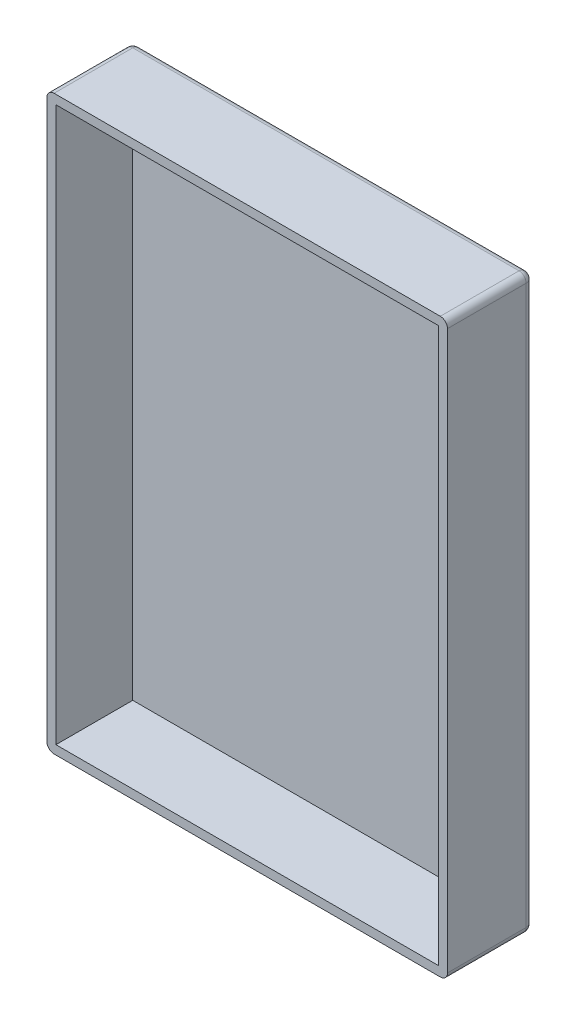
ISO-10303-21;
HEADER;
FILE_DESCRIPTION(('STEP AP214'),'2;1');
FILE_NAME('part.step','',(''),(''),'','','');
FILE_SCHEMA(('AUTOMOTIVE_DESIGN { 1 0 10303 214 1 1 1 1 }'));
ENDSEC;
DATA;
#1=APPLICATION_CONTEXT('core data for automotive mechanical design processes');
#2=APPLICATION_PROTOCOL_DEFINITION('international standard','automotive_design',2000,#1);
#3=PRODUCT_CONTEXT('',#1,'mechanical');
#4=PRODUCT('Part','Part','',(#3));
#5=PRODUCT_RELATED_PRODUCT_CATEGORY('part','',(#4));
#6=PRODUCT_DEFINITION_FORMATION('','',#4);
#7=PRODUCT_DEFINITION_CONTEXT('part definition',#1,'design');
#8=PRODUCT_DEFINITION('design','',#6,#7);
#9=PRODUCT_DEFINITION_SHAPE('','',#8);
#10=(LENGTH_UNIT() NAMED_UNIT(*) SI_UNIT(.MILLI.,.METRE.));
#11=(NAMED_UNIT(*) PLANE_ANGLE_UNIT() SI_UNIT($,.RADIAN.));
#12=(NAMED_UNIT(*) SI_UNIT($,.STERADIAN.) SOLID_ANGLE_UNIT());
#13=UNCERTAINTY_MEASURE_WITH_UNIT(LENGTH_MEASURE(1.E-05),#10,'distance_accuracy_value','');
#14=(GEOMETRIC_REPRESENTATION_CONTEXT(3) GLOBAL_UNCERTAINTY_ASSIGNED_CONTEXT((#13)) GLOBAL_UNIT_ASSIGNED_CONTEXT((#10,
#11,#12)) REPRESENTATION_CONTEXT('',''));
#15=CARTESIAN_POINT('',(0.,0.,0.));
#16=DIRECTION('',(0.,0.,1.));
#17=DIRECTION('',(1.,0.,0.));
#18=AXIS2_PLACEMENT_3D('',#15,#16,#17);
#19=CARTESIAN_POINT('',(44.45,-63.5,19.05));
#20=DIRECTION('',(0.,0.,-1.));
#21=DIRECTION('',(-1.,0.,0.));
#22=AXIS2_PLACEMENT_3D('',#19,#20,#21);
#23=PLANE('',#22);
#24=DIRECTION('',(1.,0.,0.));
#25=VECTOR('',#24,1.);
#26=CARTESIAN_POINT('',(-44.45,-63.5,19.05));
#27=LINE('',#26,#25);
#28=CARTESIAN_POINT('',(-42.8625,-63.5,19.05));
#29=VERTEX_POINT('',#28);
#30=CARTESIAN_POINT('',(42.8625,-63.5,19.05));
#31=VERTEX_POINT('',#30);
#32=EDGE_CURVE('E185',#29,#31,#27,.T.);
#33=ORIENTED_EDGE('',*,*,#32,.T.);
#34=CARTESIAN_POINT('',(42.8625,-61.9125,19.05));
#35=DIRECTION('',(0.,0.,-1.));
#36=DIRECTION('',(-1.,0.,0.));
#37=AXIS2_PLACEMENT_3D('',#34,#35,#36);
#38=CIRCLE('',#37,1.5875);
#39=CARTESIAN_POINT('',(44.45,-61.9125,19.05));
#40=VERTEX_POINT('',#39);
#41=EDGE_CURVE('E216',#31,#40,#38,.F.);
#42=ORIENTED_EDGE('',*,*,#41,.T.);
#43=DIRECTION('',(0.,1.,0.));
#44=VECTOR('',#43,1.);
#45=CARTESIAN_POINT('',(44.45,63.5,19.05));
#46=LINE('',#45,#44);
#47=CARTESIAN_POINT('',(44.45,61.9125,19.05));
#48=VERTEX_POINT('',#47);
#49=EDGE_CURVE('E188',#40,#48,#46,.T.);
#50=ORIENTED_EDGE('',*,*,#49,.T.);
#51=CARTESIAN_POINT('',(42.8625,61.9125,19.05));
#52=DIRECTION('',(0.,0.,-1.));
#53=DIRECTION('',(-1.,0.,0.));
#54=AXIS2_PLACEMENT_3D('',#51,#52,#53);
#55=CIRCLE('',#54,1.5875);
#56=CARTESIAN_POINT('',(42.8625,63.5,19.05));
#57=VERTEX_POINT('',#56);
#58=EDGE_CURVE('E214',#48,#57,#55,.F.);
#59=ORIENTED_EDGE('',*,*,#58,.T.);
#60=DIRECTION('',(-1.,0.,0.));
#61=VECTOR('',#60,1.);
#62=CARTESIAN_POINT('',(-44.45,63.5,19.05));
#63=LINE('',#62,#61);
#64=CARTESIAN_POINT('',(-42.8625,63.5,19.05));
#65=VERTEX_POINT('',#64);
#66=EDGE_CURVE('E191',#57,#65,#63,.T.);
#67=ORIENTED_EDGE('',*,*,#66,.T.);
#68=CARTESIAN_POINT('',(-42.8625,61.9125,19.05));
#69=DIRECTION('',(0.,0.,-1.));
#70=DIRECTION('',(-1.,0.,0.));
#71=AXIS2_PLACEMENT_3D('',#68,#69,#70);
#72=CIRCLE('',#71,1.5875);
#73=CARTESIAN_POINT('',(-44.45,61.9125,19.05));
#74=VERTEX_POINT('',#73);
#75=EDGE_CURVE('E210',#65,#74,#72,.F.);
#76=ORIENTED_EDGE('',*,*,#75,.T.);
#77=DIRECTION('',(0.,-1.,0.));
#78=VECTOR('',#77,1.);
#79=CARTESIAN_POINT('',(-44.45,63.5,19.05));
#80=LINE('',#79,#78);
#81=CARTESIAN_POINT('',(-44.45,-61.9125,19.05));
#82=VERTEX_POINT('',#81);
#83=EDGE_CURVE('E194',#74,#82,#80,.T.);
#84=ORIENTED_EDGE('',*,*,#83,.T.);
#85=CARTESIAN_POINT('',(-42.8625,-61.9125,19.05));
#86=DIRECTION('',(0.,0.,-1.));
#87=DIRECTION('',(-1.,0.,0.));
#88=AXIS2_PLACEMENT_3D('',#85,#86,#87);
#89=CIRCLE('',#88,1.5875);
#90=EDGE_CURVE('E212',#82,#29,#89,.F.);
#91=ORIENTED_EDGE('',*,*,#90,.T.);
#92=EDGE_LOOP('',(#33,#42,#50,#59,#67,#76,#84,#91));
#93=FACE_BOUND('',#92,.T.);
#94=DIRECTION('',(1.,0.,0.));
#95=VECTOR('',#94,1.);
#96=CARTESIAN_POINT('',(44.45,-61.5,19.05));
#97=LINE('',#96,#95);
#98=CARTESIAN_POINT('',(-42.45,-61.5,19.05));
#99=VERTEX_POINT('',#98);
#100=CARTESIAN_POINT('',(42.45,-61.5,19.05));
#101=VERTEX_POINT('',#100);
#102=EDGE_CURVE('E161',#99,#101,#97,.T.);
#103=ORIENTED_EDGE('',*,*,#102,.F.);
#104=DIRECTION('',(0.,-1.,0.));
#105=VECTOR('',#104,1.);
#106=CARTESIAN_POINT('',(-42.45,-63.5,19.05));
#107=LINE('',#106,#105);
#108=CARTESIAN_POINT('',(-42.45,61.5,19.05));
#109=VERTEX_POINT('',#108);
#110=EDGE_CURVE('E169',#109,#99,#107,.T.);
#111=ORIENTED_EDGE('',*,*,#110,.F.);
#112=DIRECTION('',(-1.,0.,0.));
#113=VECTOR('',#112,1.);
#114=CARTESIAN_POINT('',(44.45,61.5,19.05));
#115=LINE('',#114,#113);
#116=CARTESIAN_POINT('',(42.45,61.5,19.05));
#117=VERTEX_POINT('',#116);
#118=EDGE_CURVE('E56',#117,#109,#115,.T.);
#119=ORIENTED_EDGE('',*,*,#118,.F.);
#120=DIRECTION('',(0.,1.,0.));
#121=VECTOR('',#120,1.);
#122=CARTESIAN_POINT('',(42.45,-63.5,19.05));
#123=LINE('',#122,#121);
#124=EDGE_CURVE('E182',#101,#117,#123,.T.);
#125=ORIENTED_EDGE('',*,*,#124,.F.);
#126=EDGE_LOOP('',(#103,#111,#119,#125));
#127=FACE_BOUND('',#126,.T.);
#128=ADVANCED_FACE('F39',(#93,#127),#23,.F.);
#129=CARTESIAN_POINT('',(-44.45,-63.5,19.05));
#130=DIRECTION('',(0.,1.,0.));
#131=DIRECTION('',(0.,0.,1.));
#132=AXIS2_PLACEMENT_3D('',#129,#130,#131);
#133=PLANE('',#132);
#134=DIRECTION('',(1.,0.,0.));
#135=VECTOR('',#134,1.);
#136=CARTESIAN_POINT('',(44.45,-63.5,1.5875));
#137=LINE('',#136,#135);
#138=CARTESIAN_POINT('',(-42.8625,-63.5,1.5875));
#139=VERTEX_POINT('',#138);
#140=CARTESIAN_POINT('',(42.8625,-63.5,1.5875));
#141=VERTEX_POINT('',#140);
#142=EDGE_CURVE('E204',#139,#141,#137,.T.);
#143=ORIENTED_EDGE('',*,*,#142,.T.);
#144=DIRECTION('',(0.,0.,-1.));
#145=VECTOR('',#144,1.);
#146=CARTESIAN_POINT('',(42.8625,-63.5,19.05));
#147=LINE('',#146,#145);
#148=EDGE_CURVE('E208',#141,#31,#147,.F.);
#149=ORIENTED_EDGE('',*,*,#148,.T.);
#150=ORIENTED_EDGE('',*,*,#32,.F.);
#151=DIRECTION('',(0.,0.,-1.));
#152=VECTOR('',#151,1.);
#153=CARTESIAN_POINT('',(-42.8625,-63.5,19.05));
#154=LINE('',#153,#152);
#155=EDGE_CURVE('E206',#29,#139,#154,.T.);
#156=ORIENTED_EDGE('',*,*,#155,.T.);
#157=EDGE_LOOP('',(#143,#149,#150,#156));
#158=FACE_BOUND('',#157,.T.);
#159=ADVANCED_FACE('F316',(#158),#133,.F.);
#160=CARTESIAN_POINT('',(44.45,63.5,19.05));
#161=DIRECTION('',(-1.,0.,0.));
#162=DIRECTION('',(0.,-1.,0.));
#163=AXIS2_PLACEMENT_3D('',#160,#161,#162);
#164=PLANE('',#163);
#165=ORIENTED_EDGE('',*,*,#49,.F.);
#166=DIRECTION('',(0.,0.,-1.));
#167=VECTOR('',#166,1.);
#168=CARTESIAN_POINT('',(44.45,-61.9125,19.05));
#169=LINE('',#168,#167);
#170=CARTESIAN_POINT('',(44.45,-61.9125,1.5875));
#171=VERTEX_POINT('',#170);
#172=EDGE_CURVE('E201',#40,#171,#169,.T.);
#173=ORIENTED_EDGE('',*,*,#172,.T.);
#174=DIRECTION('',(0.,1.,0.));
#175=VECTOR('',#174,1.);
#176=CARTESIAN_POINT('',(44.45,63.5,1.5875));
#177=LINE('',#176,#175);
#178=CARTESIAN_POINT('',(44.45,61.9125,1.5875));
#179=VERTEX_POINT('',#178);
#180=EDGE_CURVE('E197',#171,#179,#177,.T.);
#181=ORIENTED_EDGE('',*,*,#180,.T.);
#182=DIRECTION('',(0.,0.,-1.));
#183=VECTOR('',#182,1.);
#184=CARTESIAN_POINT('',(44.45,61.9125,19.05));
#185=LINE('',#184,#183);
#186=EDGE_CURVE('E199',#179,#48,#185,.F.);
#187=ORIENTED_EDGE('',*,*,#186,.T.);
#188=EDGE_LOOP('',(#165,#173,#181,#187));
#189=FACE_BOUND('',#188,.T.);
#190=ADVANCED_FACE('F324',(#189),#164,.F.);
#191=CARTESIAN_POINT('',(-44.45,63.5,19.05));
#192=DIRECTION('',(0.,-1.,0.));
#193=DIRECTION('',(0.,0.,-1.));
#194=AXIS2_PLACEMENT_3D('',#191,#192,#193);
#195=PLANE('',#194);
#196=ORIENTED_EDGE('',*,*,#66,.F.);
#197=DIRECTION('',(0.,0.,-1.));
#198=VECTOR('',#197,1.);
#199=CARTESIAN_POINT('',(42.8625,63.5,19.05));
#200=LINE('',#199,#198);
#201=CARTESIAN_POINT('',(42.8625,63.5,1.5875));
#202=VERTEX_POINT('',#201);
#203=EDGE_CURVE('E222',#57,#202,#200,.T.);
#204=ORIENTED_EDGE('',*,*,#203,.T.);
#205=DIRECTION('',(-1.,0.,0.));
#206=VECTOR('',#205,1.);
#207=CARTESIAN_POINT('',(-44.45,63.5,1.5875));
#208=LINE('',#207,#206);
#209=CARTESIAN_POINT('',(-42.8625,63.5,1.5875));
#210=VERTEX_POINT('',#209);
#211=EDGE_CURVE('E218',#202,#210,#208,.T.);
#212=ORIENTED_EDGE('',*,*,#211,.T.);
#213=DIRECTION('',(0.,0.,-1.));
#214=VECTOR('',#213,1.);
#215=CARTESIAN_POINT('',(-42.8625,63.5,19.05));
#216=LINE('',#215,#214);
#217=EDGE_CURVE('E220',#210,#65,#216,.F.);
#218=ORIENTED_EDGE('',*,*,#217,.T.);
#219=EDGE_LOOP('',(#196,#204,#212,#218));
#220=FACE_BOUND('',#219,.T.);
#221=ADVANCED_FACE('F277',(#220),#195,.F.);
#222=CARTESIAN_POINT('',(-44.45,63.5,19.05));
#223=DIRECTION('',(1.,0.,0.));
#224=DIRECTION('',(0.,1.,0.));
#225=AXIS2_PLACEMENT_3D('',#222,#223,#224);
#226=PLANE('',#225);
#227=DIRECTION('',(0.,-1.,0.));
#228=VECTOR('',#227,1.);
#229=CARTESIAN_POINT('',(-44.45,-63.5,1.5875));
#230=LINE('',#229,#228);
#231=CARTESIAN_POINT('',(-44.45,61.9125,1.5875));
#232=VERTEX_POINT('',#231);
#233=CARTESIAN_POINT('',(-44.45,-61.9125,1.5875));
#234=VERTEX_POINT('',#233);
#235=EDGE_CURVE('E224',#232,#234,#230,.T.);
#236=ORIENTED_EDGE('',*,*,#235,.T.);
#237=DIRECTION('',(0.,0.,-1.));
#238=VECTOR('',#237,1.);
#239=CARTESIAN_POINT('',(-44.45,-61.9125,19.05));
#240=LINE('',#239,#238);
#241=EDGE_CURVE('E228',#234,#82,#240,.F.);
#242=ORIENTED_EDGE('',*,*,#241,.T.);
#243=ORIENTED_EDGE('',*,*,#83,.F.);
#244=DIRECTION('',(0.,0.,-1.));
#245=VECTOR('',#244,1.);
#246=CARTESIAN_POINT('',(-44.45,61.9125,19.05));
#247=LINE('',#246,#245);
#248=EDGE_CURVE('E226',#74,#232,#247,.T.);
#249=ORIENTED_EDGE('',*,*,#248,.T.);
#250=EDGE_LOOP('',(#236,#242,#243,#249));
#251=FACE_BOUND('',#250,.T.);
#252=ADVANCED_FACE('F306',(#251),#226,.F.);
#253=CARTESIAN_POINT('',(44.45,-63.5,0.));
#254=DIRECTION('',(0.,0.,-1.));
#255=DIRECTION('',(-1.,0.,0.));
#256=AXIS2_PLACEMENT_3D('',#253,#254,#255);
#257=PLANE('',#256);
#258=DIRECTION('',(-1.,0.,0.));
#259=VECTOR('',#258,1.);
#260=CARTESIAN_POINT('',(44.45,61.9125,0.));
#261=LINE('',#260,#259);
#262=CARTESIAN_POINT('',(-42.8625,61.9125,0.));
#263=VERTEX_POINT('',#262);
#264=CARTESIAN_POINT('',(42.8625,61.9125,0.));
#265=VERTEX_POINT('',#264);
#266=EDGE_CURVE('E230',#263,#265,#261,.F.);
#267=ORIENTED_EDGE('',*,*,#266,.T.);
#268=DIRECTION('',(0.,1.,0.));
#269=VECTOR('',#268,1.);
#270=CARTESIAN_POINT('',(42.8625,-63.5,0.));
#271=LINE('',#270,#269);
#272=CARTESIAN_POINT('',(42.8625,-61.9125,0.));
#273=VERTEX_POINT('',#272);
#274=EDGE_CURVE('E11',#265,#273,#271,.F.);
#275=ORIENTED_EDGE('',*,*,#274,.T.);
#276=DIRECTION('',(1.,0.,0.));
#277=VECTOR('',#276,1.);
#278=CARTESIAN_POINT('',(-44.45,-61.9125,0.));
#279=LINE('',#278,#277);
#280=CARTESIAN_POINT('',(-42.8625,-61.9125,0.));
#281=VERTEX_POINT('',#280);
#282=EDGE_CURVE('E48',#273,#281,#279,.F.);
#283=ORIENTED_EDGE('',*,*,#282,.T.);
#284=DIRECTION('',(0.,-1.,0.));
#285=VECTOR('',#284,1.);
#286=CARTESIAN_POINT('',(-42.8625,63.5,0.));
#287=LINE('',#286,#285);
#288=EDGE_CURVE('E232',#281,#263,#287,.F.);
#289=ORIENTED_EDGE('',*,*,#288,.T.);
#290=EDGE_LOOP('',(#267,#275,#283,#289));
#291=FACE_BOUND('',#290,.T.);
#292=ADVANCED_FACE('F299',(#291),#257,.T.);
#293=CARTESIAN_POINT('',(-42.8625,61.9125,19.05));
#294=DIRECTION('',(0.,0.,-1.));
#295=DIRECTION('',(-1.,0.,0.));
#296=AXIS2_PLACEMENT_3D('',#293,#294,#295);
#297=CYLINDRICAL_SURFACE('',#296,1.5875);
#298=CARTESIAN_POINT('',(-42.8625,61.9125,1.5875));
#299=DIRECTION('',(0.,0.,-1.));
#300=DIRECTION('',(-1.,0.,0.));
#301=AXIS2_PLACEMENT_3D('',#298,#299,#300);
#302=CIRCLE('',#301,1.5875);
#303=EDGE_CURVE('E43',#232,#210,#302,.T.);
#304=ORIENTED_EDGE('',*,*,#303,.F.);
#305=ORIENTED_EDGE('',*,*,#248,.F.);
#306=ORIENTED_EDGE('',*,*,#75,.F.);
#307=ORIENTED_EDGE('',*,*,#217,.F.);
#308=EDGE_LOOP('',(#304,#305,#306,#307));
#309=FACE_BOUND('',#308,.T.);
#310=ADVANCED_FACE('F41',(#309),#297,.T.);
#311=CARTESIAN_POINT('',(-42.8625,61.9125,1.5875));
#312=DIRECTION('',(0.,0.,1.));
#313=DIRECTION('',(1.,0.,0.));
#314=AXIS2_PLACEMENT_3D('',#311,#312,#313);
#315=SPHERICAL_SURFACE('',#314,1.5875);
#316=CARTESIAN_POINT('',(-42.8625,61.9125,1.5875));
#317=DIRECTION('',(0.,1.,0.));
#318=DIRECTION('',(0.,0.,1.));
#319=AXIS2_PLACEMENT_3D('',#316,#317,#318);
#320=CIRCLE('',#319,1.5875);
#321=EDGE_CURVE('E257',#232,#263,#320,.F.);
#322=ORIENTED_EDGE('',*,*,#321,.F.);
#323=ORIENTED_EDGE('',*,*,#303,.T.);
#324=CARTESIAN_POINT('',(-42.8625,61.9125,1.5875));
#325=DIRECTION('',(-1.,0.,0.));
#326=DIRECTION('',(0.,0.,1.));
#327=AXIS2_PLACEMENT_3D('',#324,#325,#326);
#328=CIRCLE('',#327,1.5875);
#329=EDGE_CURVE('E259',#263,#210,#328,.F.);
#330=ORIENTED_EDGE('',*,*,#329,.F.);
#331=EDGE_LOOP('',(#322,#323,#330));
#332=FACE_BOUND('',#331,.T.);
#333=ADVANCED_FACE('F269',(#332),#315,.T.);
#334=CARTESIAN_POINT('',(42.8625,61.9125,19.05));
#335=DIRECTION('',(0.,0.,-1.));
#336=DIRECTION('',(-1.,0.,0.));
#337=AXIS2_PLACEMENT_3D('',#334,#335,#336);
#338=CYLINDRICAL_SURFACE('',#337,1.5875);
#339=ORIENTED_EDGE('',*,*,#58,.F.);
#340=ORIENTED_EDGE('',*,*,#186,.F.);
#341=CARTESIAN_POINT('',(42.8625,61.9125,1.5875));
#342=DIRECTION('',(0.,0.,-1.));
#343=DIRECTION('',(-1.,0.,0.));
#344=AXIS2_PLACEMENT_3D('',#341,#342,#343);
#345=CIRCLE('',#344,1.5875);
#346=EDGE_CURVE('E254',#202,#179,#345,.T.);
#347=ORIENTED_EDGE('',*,*,#346,.F.);
#348=ORIENTED_EDGE('',*,*,#203,.F.);
#349=EDGE_LOOP('',(#339,#340,#347,#348));
#350=FACE_BOUND('',#349,.T.);
#351=ADVANCED_FACE('F286',(#350),#338,.T.);
#352=CARTESIAN_POINT('',(-44.45,61.9125,1.5875));
#353=DIRECTION('',(1.,0.,0.));
#354=DIRECTION('',(0.,0.,-1.));
#355=AXIS2_PLACEMENT_3D('',#352,#353,#354);
#356=CYLINDRICAL_SURFACE('',#355,1.5875);
#357=ORIENTED_EDGE('',*,*,#329,.T.);
#358=ORIENTED_EDGE('',*,*,#211,.F.);
#359=CARTESIAN_POINT('',(42.8625,61.9125,1.5875));
#360=DIRECTION('',(1.,0.,0.));
#361=DIRECTION('',(0.,1.,0.));
#362=AXIS2_PLACEMENT_3D('',#359,#360,#361);
#363=CIRCLE('',#362,1.5875);
#364=EDGE_CURVE('E251',#265,#202,#363,.T.);
#365=ORIENTED_EDGE('',*,*,#364,.F.);
#366=ORIENTED_EDGE('',*,*,#266,.F.);
#367=EDGE_LOOP('',(#357,#358,#365,#366));
#368=FACE_BOUND('',#367,.T.);
#369=ADVANCED_FACE('F289',(#368),#356,.T.);
#370=CARTESIAN_POINT('',(-42.8625,63.5,1.5875));
#371=DIRECTION('',(0.,1.,0.));
#372=DIRECTION('',(-1.,0.,0.));
#373=AXIS2_PLACEMENT_3D('',#370,#371,#372);
#374=CYLINDRICAL_SURFACE('',#373,1.5875);
#375=ORIENTED_EDGE('',*,*,#321,.T.);
#376=ORIENTED_EDGE('',*,*,#288,.F.);
#377=CARTESIAN_POINT('',(-42.8625,-61.9125,1.5875));
#378=DIRECTION('',(0.,-1.,0.));
#379=DIRECTION('',(0.,0.,-1.));
#380=AXIS2_PLACEMENT_3D('',#377,#378,#379);
#381=CIRCLE('',#380,1.5875);
#382=EDGE_CURVE('E248',#234,#281,#381,.T.);
#383=ORIENTED_EDGE('',*,*,#382,.F.);
#384=ORIENTED_EDGE('',*,*,#235,.F.);
#385=EDGE_LOOP('',(#375,#376,#383,#384));
#386=FACE_BOUND('',#385,.T.);
#387=ADVANCED_FACE('F303',(#386),#374,.T.);
#388=CARTESIAN_POINT('',(-42.8625,-61.9125,19.05));
#389=DIRECTION('',(0.,0.,-1.));
#390=DIRECTION('',(-1.,0.,0.));
#391=AXIS2_PLACEMENT_3D('',#388,#389,#390);
#392=CYLINDRICAL_SURFACE('',#391,1.5875);
#393=ORIENTED_EDGE('',*,*,#90,.F.);
#394=ORIENTED_EDGE('',*,*,#241,.F.);
#395=CARTESIAN_POINT('',(-42.8625,-61.9125,1.5875));
#396=DIRECTION('',(0.,0.,-1.));
#397=DIRECTION('',(-1.,0.,0.));
#398=AXIS2_PLACEMENT_3D('',#395,#396,#397);
#399=CIRCLE('',#398,1.5875);
#400=EDGE_CURVE('E245',#139,#234,#399,.T.);
#401=ORIENTED_EDGE('',*,*,#400,.F.);
#402=ORIENTED_EDGE('',*,*,#155,.F.);
#403=EDGE_LOOP('',(#393,#394,#401,#402));
#404=FACE_BOUND('',#403,.T.);
#405=ADVANCED_FACE('F310',(#404),#392,.T.);
#406=CARTESIAN_POINT('',(42.8625,61.9125,1.5875));
#407=DIRECTION('',(0.,0.,1.));
#408=DIRECTION('',(1.,0.,0.));
#409=AXIS2_PLACEMENT_3D('',#406,#407,#408);
#410=SPHERICAL_SURFACE('',#409,1.5875);
#411=ORIENTED_EDGE('',*,*,#364,.T.);
#412=ORIENTED_EDGE('',*,*,#346,.T.);
#413=CARTESIAN_POINT('',(42.8625,61.9125,1.5875));
#414=DIRECTION('',(0.,1.,0.));
#415=DIRECTION('',(0.,0.,1.));
#416=AXIS2_PLACEMENT_3D('',#413,#414,#415);
#417=CIRCLE('',#416,1.5875);
#418=EDGE_CURVE('E242',#265,#179,#417,.F.);
#419=ORIENTED_EDGE('',*,*,#418,.F.);
#420=EDGE_LOOP('',(#411,#412,#419));
#421=FACE_BOUND('',#420,.T.);
#422=ADVANCED_FACE('F293',(#421),#410,.T.);
#423=CARTESIAN_POINT('',(-42.8625,-61.9125,1.5875));
#424=DIRECTION('',(0.,0.,1.));
#425=DIRECTION('',(1.,0.,0.));
#426=AXIS2_PLACEMENT_3D('',#423,#424,#425);
#427=SPHERICAL_SURFACE('',#426,1.5875);
#428=ORIENTED_EDGE('',*,*,#400,.T.);
#429=ORIENTED_EDGE('',*,*,#382,.T.);
#430=CARTESIAN_POINT('',(-42.8625,-61.9125,1.5875));
#431=DIRECTION('',(-1.,0.,0.));
#432=DIRECTION('',(0.,0.,1.));
#433=AXIS2_PLACEMENT_3D('',#430,#431,#432);
#434=CIRCLE('',#433,1.5875);
#435=EDGE_CURVE('E239',#139,#281,#434,.F.);
#436=ORIENTED_EDGE('',*,*,#435,.F.);
#437=EDGE_LOOP('',(#428,#429,#436));
#438=FACE_BOUND('',#437,.T.);
#439=ADVANCED_FACE('F391',(#438),#427,.T.);
#440=CARTESIAN_POINT('',(42.8625,63.5,1.5875));
#441=DIRECTION('',(0.,-1.,0.));
#442=DIRECTION('',(1.,0.,0.));
#443=AXIS2_PLACEMENT_3D('',#440,#441,#442);
#444=CYLINDRICAL_SURFACE('',#443,1.5875);
#445=ORIENTED_EDGE('',*,*,#418,.T.);
#446=ORIENTED_EDGE('',*,*,#180,.F.);
#447=CARTESIAN_POINT('',(42.8625,-61.9125,1.5875));
#448=DIRECTION('',(0.,-1.,0.));
#449=DIRECTION('',(1.,0.,0.));
#450=AXIS2_PLACEMENT_3D('',#447,#448,#449);
#451=CIRCLE('',#450,1.5875);
#452=EDGE_CURVE('E237',#273,#171,#451,.T.);
#453=ORIENTED_EDGE('',*,*,#452,.F.);
#454=ORIENTED_EDGE('',*,*,#274,.F.);
#455=EDGE_LOOP('',(#445,#446,#453,#454));
#456=FACE_BOUND('',#455,.T.);
#457=ADVANCED_FACE('F296',(#456),#444,.T.);
#458=CARTESIAN_POINT('',(-44.45,-61.9125,1.5875));
#459=DIRECTION('',(-1.,0.,0.));
#460=DIRECTION('',(0.,0.,1.));
#461=AXIS2_PLACEMENT_3D('',#458,#459,#460);
#462=CYLINDRICAL_SURFACE('',#461,1.5875);
#463=ORIENTED_EDGE('',*,*,#435,.T.);
#464=ORIENTED_EDGE('',*,*,#282,.F.);
#465=CARTESIAN_POINT('',(42.8625,-61.9125,1.5875));
#466=DIRECTION('',(1.,0.,0.));
#467=DIRECTION('',(0.,0.,-1.));
#468=AXIS2_PLACEMENT_3D('',#465,#466,#467);
#469=CIRCLE('',#468,1.5875);
#470=EDGE_CURVE('E64',#141,#273,#469,.T.);
#471=ORIENTED_EDGE('',*,*,#470,.F.);
#472=ORIENTED_EDGE('',*,*,#142,.F.);
#473=EDGE_LOOP('',(#463,#464,#471,#472));
#474=FACE_BOUND('',#473,.T.);
#475=ADVANCED_FACE('F405',(#474),#462,.T.);
#476=CARTESIAN_POINT('',(42.8625,-61.9125,1.5875));
#477=DIRECTION('',(0.,0.,1.));
#478=DIRECTION('',(1.,0.,0.));
#479=AXIS2_PLACEMENT_3D('',#476,#477,#478);
#480=SPHERICAL_SURFACE('',#479,1.5875);
#481=ORIENTED_EDGE('',*,*,#470,.T.);
#482=ORIENTED_EDGE('',*,*,#452,.T.);
#483=CARTESIAN_POINT('',(42.8625,-61.9125,1.5875));
#484=DIRECTION('',(0.,0.,-1.));
#485=DIRECTION('',(-1.,0.,0.));
#486=AXIS2_PLACEMENT_3D('',#483,#484,#485);
#487=CIRCLE('',#486,1.5875);
#488=EDGE_CURVE('E155',#141,#171,#487,.F.);
#489=ORIENTED_EDGE('',*,*,#488,.F.);
#490=EDGE_LOOP('',(#481,#482,#489));
#491=FACE_BOUND('',#490,.T.);
#492=ADVANCED_FACE('F322',(#491),#480,.T.);
#493=CARTESIAN_POINT('',(42.8625,-61.9125,19.05));
#494=DIRECTION('',(0.,0.,-1.));
#495=DIRECTION('',(-1.,0.,0.));
#496=AXIS2_PLACEMENT_3D('',#493,#494,#495);
#497=CYLINDRICAL_SURFACE('',#496,1.5875);
#498=ORIENTED_EDGE('',*,*,#41,.F.);
#499=ORIENTED_EDGE('',*,*,#148,.F.);
#500=ORIENTED_EDGE('',*,*,#488,.T.);
#501=ORIENTED_EDGE('',*,*,#172,.F.);
#502=EDGE_LOOP('',(#498,#499,#500,#501));
#503=FACE_BOUND('',#502,.T.);
#504=ADVANCED_FACE('F320',(#503),#497,.T.);
#505=CARTESIAN_POINT('',(-44.45,-61.5,19.05));
#506=DIRECTION('',(0.,1.,0.));
#507=DIRECTION('',(0.,0.,1.));
#508=AXIS2_PLACEMENT_3D('',#505,#506,#507);
#509=PLANE('',#508);
#510=DIRECTION('',(-1.,0.,0.));
#511=VECTOR('',#510,1.);
#512=CARTESIAN_POINT('',(-44.45,-61.5,2.));
#513=LINE('',#512,#511);
#514=CARTESIAN_POINT('',(42.45,-61.5,2.));
#515=VERTEX_POINT('',#514);
#516=CARTESIAN_POINT('',(-42.45,-61.5,2.));
#517=VERTEX_POINT('',#516);
#518=EDGE_CURVE('E146',#515,#517,#513,.T.);
#519=ORIENTED_EDGE('',*,*,#518,.T.);
#520=DIRECTION('',(0.,0.,1.));
#521=VECTOR('',#520,1.);
#522=CARTESIAN_POINT('',(-42.45,-61.5,19.05));
#523=LINE('',#522,#521);
#524=EDGE_CURVE('E175',#517,#99,#523,.T.);
#525=ORIENTED_EDGE('',*,*,#524,.T.);
#526=ORIENTED_EDGE('',*,*,#102,.T.);
#527=DIRECTION('',(0.,0.,1.));
#528=VECTOR('',#527,1.);
#529=CARTESIAN_POINT('',(42.45,-61.5,19.05));
#530=LINE('',#529,#528);
#531=EDGE_CURVE('E158',#515,#101,#530,.T.);
#532=ORIENTED_EDGE('',*,*,#531,.F.);
#533=EDGE_LOOP('',(#519,#525,#526,#532));
#534=FACE_BOUND('',#533,.T.);
#535=ADVANCED_FACE('F159',(#534),#509,.T.);
#536=CARTESIAN_POINT('',(42.45,63.5,19.05));
#537=DIRECTION('',(-1.,0.,0.));
#538=DIRECTION('',(0.,-1.,0.));
#539=AXIS2_PLACEMENT_3D('',#536,#537,#538);
#540=PLANE('',#539);
#541=ORIENTED_EDGE('',*,*,#124,.T.);
#542=DIRECTION('',(0.,0.,1.));
#543=VECTOR('',#542,1.);
#544=CARTESIAN_POINT('',(42.45,61.5,19.05));
#545=LINE('',#544,#543);
#546=CARTESIAN_POINT('',(42.45,61.5,2.));
#547=VERTEX_POINT('',#546);
#548=EDGE_CURVE('E166',#547,#117,#545,.T.);
#549=ORIENTED_EDGE('',*,*,#548,.F.);
#550=DIRECTION('',(0.,1.,0.));
#551=VECTOR('',#550,1.);
#552=CARTESIAN_POINT('',(42.45,-63.5,2.));
#553=LINE('',#552,#551);
#554=EDGE_CURVE('E151',#515,#547,#553,.T.);
#555=ORIENTED_EDGE('',*,*,#554,.F.);
#556=ORIENTED_EDGE('',*,*,#531,.T.);
#557=EDGE_LOOP('',(#541,#549,#555,#556));
#558=FACE_BOUND('',#557,.T.);
#559=ADVANCED_FACE('F168',(#558),#540,.T.);
#560=CARTESIAN_POINT('',(-44.45,61.5,19.05));
#561=DIRECTION('',(0.,-1.,0.));
#562=DIRECTION('',(0.,0.,-1.));
#563=AXIS2_PLACEMENT_3D('',#560,#561,#562);
#564=PLANE('',#563);
#565=ORIENTED_EDGE('',*,*,#118,.T.);
#566=DIRECTION('',(0.,0.,-1.));
#567=VECTOR('',#566,1.);
#568=CARTESIAN_POINT('',(-42.45,61.5,19.05));
#569=LINE('',#568,#567);
#570=CARTESIAN_POINT('',(-42.45,61.5,2.));
#571=VERTEX_POINT('',#570);
#572=EDGE_CURVE('E178',#109,#571,#569,.T.);
#573=ORIENTED_EDGE('',*,*,#572,.T.);
#574=DIRECTION('',(-1.,0.,0.));
#575=VECTOR('',#574,1.);
#576=CARTESIAN_POINT('',(44.45,61.5,2.));
#577=LINE('',#576,#575);
#578=EDGE_CURVE('E165',#547,#571,#577,.T.);
#579=ORIENTED_EDGE('',*,*,#578,.F.);
#580=ORIENTED_EDGE('',*,*,#548,.T.);
#581=EDGE_LOOP('',(#565,#573,#579,#580));
#582=FACE_BOUND('',#581,.T.);
#583=ADVANCED_FACE('F437',(#582),#564,.T.);
#584=CARTESIAN_POINT('',(-42.45,63.5,19.05));
#585=DIRECTION('',(1.,0.,0.));
#586=DIRECTION('',(0.,1.,0.));
#587=AXIS2_PLACEMENT_3D('',#584,#585,#586);
#588=PLANE('',#587);
#589=DIRECTION('',(0.,1.,0.));
#590=VECTOR('',#589,1.);
#591=CARTESIAN_POINT('',(-42.45,63.5,2.));
#592=LINE('',#591,#590);
#593=EDGE_CURVE('E153',#517,#571,#592,.T.);
#594=ORIENTED_EDGE('',*,*,#593,.T.);
#595=ORIENTED_EDGE('',*,*,#572,.F.);
#596=ORIENTED_EDGE('',*,*,#110,.T.);
#597=ORIENTED_EDGE('',*,*,#524,.F.);
#598=EDGE_LOOP('',(#594,#595,#596,#597));
#599=FACE_BOUND('',#598,.T.);
#600=ADVANCED_FACE('F444',(#599),#588,.T.);
#601=CARTESIAN_POINT('',(44.45,-63.5,2.));
#602=DIRECTION('',(0.,0.,-1.));
#603=DIRECTION('',(-1.,0.,0.));
#604=AXIS2_PLACEMENT_3D('',#601,#602,#603);
#605=PLANE('',#604);
#606=ORIENTED_EDGE('',*,*,#578,.T.);
#607=ORIENTED_EDGE('',*,*,#593,.F.);
#608=ORIENTED_EDGE('',*,*,#518,.F.);
#609=ORIENTED_EDGE('',*,*,#554,.T.);
#610=EDGE_LOOP('',(#606,#607,#608,#609));
#611=FACE_BOUND('',#610,.T.);
#612=ADVANCED_FACE('F149',(#611),#605,.F.);
#613=CLOSED_SHELL('',(#128,#159,#190,#221,#252,#292,#310,#333,#351,#369,#387,#405,#422,#439,
#457,#475,#492,#504,#535,#559,#583,#600,#612));
#614=MANIFOLD_SOLID_BREP('B2',#613);
#615=ADVANCED_BREP_SHAPE_REPRESENTATION('',(#18,#614),#14);
#616=SHAPE_DEFINITION_REPRESENTATION(#9,#615);
ENDSEC;
END-ISO-10303-21;
